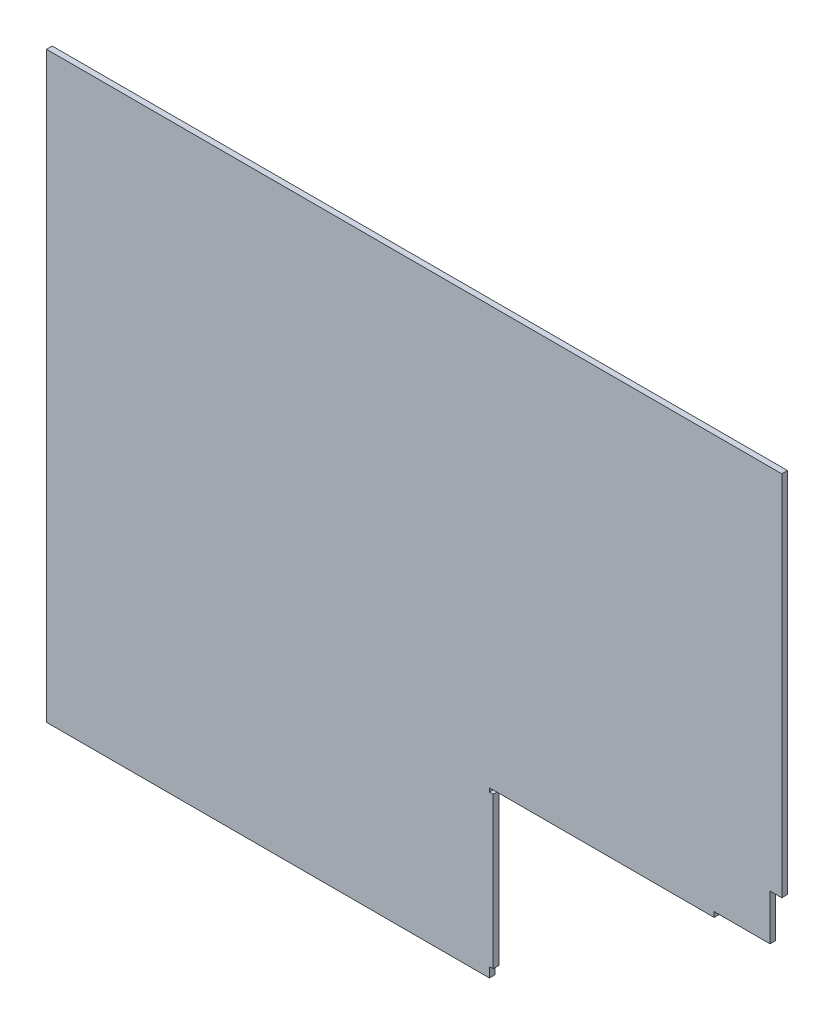
ISO-10303-21;
HEADER;
FILE_DESCRIPTION(('STEP AP214'),'2;1');
FILE_NAME('part.step','',(''),(''),'','','');
FILE_SCHEMA(('AUTOMOTIVE_DESIGN { 1 0 10303 214 1 1 1 1 }'));
ENDSEC;
DATA;
#1=APPLICATION_CONTEXT('core data for automotive mechanical design processes');
#2=APPLICATION_PROTOCOL_DEFINITION('international standard','automotive_design',2000,#1);
#3=PRODUCT_CONTEXT('',#1,'mechanical');
#4=PRODUCT('Part','Part','',(#3));
#5=PRODUCT_RELATED_PRODUCT_CATEGORY('part','',(#4));
#6=PRODUCT_DEFINITION_FORMATION('','',#4);
#7=PRODUCT_DEFINITION_CONTEXT('part definition',#1,'design');
#8=PRODUCT_DEFINITION('design','',#6,#7);
#9=PRODUCT_DEFINITION_SHAPE('','',#8);
#10=(LENGTH_UNIT() NAMED_UNIT(*) SI_UNIT(.MILLI.,.METRE.));
#11=(NAMED_UNIT(*) PLANE_ANGLE_UNIT() SI_UNIT($,.RADIAN.));
#12=(NAMED_UNIT(*) SI_UNIT($,.STERADIAN.) SOLID_ANGLE_UNIT());
#13=UNCERTAINTY_MEASURE_WITH_UNIT(LENGTH_MEASURE(1.E-05),#10,'distance_accuracy_value','');
#14=(GEOMETRIC_REPRESENTATION_CONTEXT(3) GLOBAL_UNCERTAINTY_ASSIGNED_CONTEXT((#13)) GLOBAL_UNIT_ASSIGNED_CONTEXT((#10,
#11,#12)) REPRESENTATION_CONTEXT('',''));
#15=CARTESIAN_POINT('',(0.,0.,0.));
#16=DIRECTION('',(0.,0.,1.));
#17=DIRECTION('',(1.,0.,0.));
#18=AXIS2_PLACEMENT_3D('',#15,#16,#17);
#19=CARTESIAN_POINT('',(289.5,-229.5,2.2479));
#20=DIRECTION('',(-1.,0.,0.));
#21=DIRECTION('',(0.,0.,1.));
#22=AXIS2_PLACEMENT_3D('',#19,#20,#21);
#23=PLANE('',#22);
#24=DIRECTION('',(0.,1.,0.));
#25=VECTOR('',#24,1.);
#26=CARTESIAN_POINT('',(289.5,-229.5,2.2479));
#27=LINE('',#26,#25);
#28=CARTESIAN_POINT('',(289.5,-59.6999999999961,2.24790000000002));
#29=VERTEX_POINT('',#28);
#30=CARTESIAN_POINT('',(289.5,229.5,2.2479));
#31=VERTEX_POINT('',#30);
#32=EDGE_CURVE('E78',#29,#31,#27,.T.);
#33=ORIENTED_EDGE('',*,*,#32,.F.);
#34=DIRECTION('',(0.,0.,-1.));
#35=VECTOR('',#34,1.);
#36=CARTESIAN_POINT('',(289.5,-59.6999999999961,2.2479));
#37=LINE('',#36,#35);
#38=CARTESIAN_POINT('',(289.5,-59.6999999999961,-2.2479));
#39=VERTEX_POINT('',#38);
#40=EDGE_CURVE('E206',#29,#39,#37,.T.);
#41=ORIENTED_EDGE('',*,*,#40,.T.);
#42=DIRECTION('',(0.,1.,0.));
#43=VECTOR('',#42,1.);
#44=CARTESIAN_POINT('',(289.5,-229.5,-2.2479));
#45=LINE('',#44,#43);
#46=CARTESIAN_POINT('',(289.5,229.5,-2.2479));
#47=VERTEX_POINT('',#46);
#48=EDGE_CURVE('E211',#39,#47,#45,.T.);
#49=ORIENTED_EDGE('',*,*,#48,.T.);
#50=DIRECTION('',(0.,0.,-1.));
#51=VECTOR('',#50,1.);
#52=CARTESIAN_POINT('',(289.5,229.5,2.2479));
#53=LINE('',#52,#51);
#54=EDGE_CURVE('E40',#31,#47,#53,.T.);
#55=ORIENTED_EDGE('',*,*,#54,.F.);
#56=EDGE_LOOP('',(#33,#41,#49,#55));
#57=FACE_BOUND('',#56,.T.);
#58=ADVANCED_FACE('F33',(#57),#23,.F.);
#59=CARTESIAN_POINT('',(-289.5,229.5,2.2479));
#60=DIRECTION('',(0.,-1.,0.));
#61=DIRECTION('',(0.,0.,-1.));
#62=AXIS2_PLACEMENT_3D('',#59,#60,#61);
#63=PLANE('',#62);
#64=DIRECTION('',(-1.,0.,0.));
#65=VECTOR('',#64,1.);
#66=CARTESIAN_POINT('',(-289.5,229.5,-2.2479));
#67=LINE('',#66,#65);
#68=CARTESIAN_POINT('',(-289.5,229.5,-2.2479));
#69=VERTEX_POINT('',#68);
#70=EDGE_CURVE('E221',#47,#69,#67,.T.);
#71=ORIENTED_EDGE('',*,*,#70,.T.);
#72=DIRECTION('',(0.,0.,-1.));
#73=VECTOR('',#72,1.);
#74=CARTESIAN_POINT('',(-289.5,229.5,2.2479));
#75=LINE('',#74,#73);
#76=CARTESIAN_POINT('',(-289.5,229.5,2.2479));
#77=VERTEX_POINT('',#76);
#78=EDGE_CURVE('E226',#77,#69,#75,.T.);
#79=ORIENTED_EDGE('',*,*,#78,.F.);
#80=DIRECTION('',(-1.,0.,0.));
#81=VECTOR('',#80,1.);
#82=CARTESIAN_POINT('',(-289.5,229.5,2.2479));
#83=LINE('',#82,#81);
#84=EDGE_CURVE('E213',#31,#77,#83,.T.);
#85=ORIENTED_EDGE('',*,*,#84,.F.);
#86=ORIENTED_EDGE('',*,*,#54,.T.);
#87=EDGE_LOOP('',(#71,#79,#85,#86));
#88=FACE_BOUND('',#87,.T.);
#89=ADVANCED_FACE('F230',(#88),#63,.F.);
#90=CARTESIAN_POINT('',(-289.5,-229.5,2.2479));
#91=DIRECTION('',(1.,0.,0.));
#92=DIRECTION('',(0.,0.,-1.));
#93=AXIS2_PLACEMENT_3D('',#90,#91,#92);
#94=PLANE('',#93);
#95=DIRECTION('',(0.,-1.,0.));
#96=VECTOR('',#95,1.);
#97=CARTESIAN_POINT('',(-289.5,-229.5,-2.2479));
#98=LINE('',#97,#96);
#99=CARTESIAN_POINT('',(-289.5,-229.5,-2.2479));
#100=VERTEX_POINT('',#99);
#101=EDGE_CURVE('E73',#69,#100,#98,.T.);
#102=ORIENTED_EDGE('',*,*,#101,.T.);
#103=DIRECTION('',(0.,0.,-1.));
#104=VECTOR('',#103,1.);
#105=CARTESIAN_POINT('',(-289.5,-229.5,2.2479));
#106=LINE('',#105,#104);
#107=CARTESIAN_POINT('',(-289.5,-229.5,2.2479));
#108=VERTEX_POINT('',#107);
#109=EDGE_CURVE('E219',#108,#100,#106,.T.);
#110=ORIENTED_EDGE('',*,*,#109,.F.);
#111=DIRECTION('',(0.,-1.,0.));
#112=VECTOR('',#111,1.);
#113=CARTESIAN_POINT('',(-289.5,-229.5,2.2479));
#114=LINE('',#113,#112);
#115=EDGE_CURVE('E56',#77,#108,#114,.T.);
#116=ORIENTED_EDGE('',*,*,#115,.F.);
#117=ORIENTED_EDGE('',*,*,#78,.T.);
#118=EDGE_LOOP('',(#102,#110,#116,#117));
#119=FACE_BOUND('',#118,.T.);
#120=ADVANCED_FACE('F239',(#119),#94,.F.);
#121=CARTESIAN_POINT('',(-289.5,-229.5,2.2479));
#122=DIRECTION('',(0.,1.,0.));
#123=DIRECTION('',(0.,0.,1.));
#124=AXIS2_PLACEMENT_3D('',#121,#122,#123);
#125=PLANE('',#124);
#126=DIRECTION('',(1.,0.,0.));
#127=VECTOR('',#126,1.);
#128=CARTESIAN_POINT('',(-289.5,-229.5,-2.2479));
#129=LINE('',#128,#127);
#130=CARTESIAN_POINT('',(59.2499935625001,-229.5,-2.2479));
#131=VERTEX_POINT('',#130);
#132=EDGE_CURVE('E214',#100,#131,#129,.T.);
#133=ORIENTED_EDGE('',*,*,#132,.T.);
#134=DIRECTION('',(0.,0.,1.));
#135=VECTOR('',#134,1.);
#136=CARTESIAN_POINT('',(59.2499935625001,-229.5,2.2479));
#137=LINE('',#136,#135);
#138=CARTESIAN_POINT('',(59.2499935625001,-229.5,2.24790000000002));
#139=VERTEX_POINT('',#138);
#140=EDGE_CURVE('E148',#131,#139,#137,.T.);
#141=ORIENTED_EDGE('',*,*,#140,.T.);
#142=DIRECTION('',(1.,0.,0.));
#143=VECTOR('',#142,1.);
#144=CARTESIAN_POINT('',(-289.5,-229.5,2.2479));
#145=LINE('',#144,#143);
#146=EDGE_CURVE('E217',#108,#139,#145,.T.);
#147=ORIENTED_EDGE('',*,*,#146,.F.);
#148=ORIENTED_EDGE('',*,*,#109,.T.);
#149=EDGE_LOOP('',(#133,#141,#147,#148));
#150=FACE_BOUND('',#149,.T.);
#151=ADVANCED_FACE('F237',(#150),#125,.F.);
#152=CARTESIAN_POINT('',(0.,0.,2.2479));
#153=DIRECTION('',(0.,0.,-1.));
#154=DIRECTION('',(-1.,0.,0.));
#155=AXIS2_PLACEMENT_3D('',#152,#153,#154);
#156=PLANE('',#155);
#157=ORIENTED_EDGE('',*,*,#146,.T.);
#158=DIRECTION('',(0.,-1.,0.));
#159=VECTOR('',#158,1.);
#160=CARTESIAN_POINT('',(59.2499935625001,-221.699999999993,2.24790000000002));
#161=LINE('',#160,#159);
#162=CARTESIAN_POINT('',(59.2499935625001,-221.699999999993,2.24790000000002));
#163=VERTEX_POINT('',#162);
#164=EDGE_CURVE('E191',#163,#139,#161,.T.);
#165=ORIENTED_EDGE('',*,*,#164,.F.);
#166=DIRECTION('',(-1.,0.,0.));
#167=VECTOR('',#166,1.);
#168=CARTESIAN_POINT('',(62.2499935625004,-221.699999999993,2.24790000000002));
#169=LINE('',#168,#167);
#170=CARTESIAN_POINT('',(62.2499935625004,-221.699999999993,2.24790000000002));
#171=VERTEX_POINT('',#170);
#172=EDGE_CURVE('E160',#171,#163,#169,.T.);
#173=ORIENTED_EDGE('',*,*,#172,.F.);
#174=DIRECTION('',(0.,-1.,0.));
#175=VECTOR('',#174,1.);
#176=CARTESIAN_POINT('',(62.2499935625004,-102.699999999993,2.24790000000002));
#177=LINE('',#176,#175);
#178=CARTESIAN_POINT('',(62.2499935625004,-102.699999999993,2.24790000000002));
#179=VERTEX_POINT('',#178);
#180=EDGE_CURVE('E382',#179,#171,#177,.T.);
#181=ORIENTED_EDGE('',*,*,#180,.F.);
#182=DIRECTION('',(1.,0.,0.));
#183=VECTOR('',#182,1.);
#184=CARTESIAN_POINT('',(59.2499935625001,-102.699999999993,2.24790000000002));
#185=LINE('',#184,#183);
#186=CARTESIAN_POINT('',(59.2499935625001,-102.699999999993,2.24790000000002));
#187=VERTEX_POINT('',#186);
#188=EDGE_CURVE('E384',#187,#179,#185,.T.);
#189=ORIENTED_EDGE('',*,*,#188,.F.);
#190=DIRECTION('',(0.,-1.,0.));
#191=VECTOR('',#190,1.);
#192=CARTESIAN_POINT('',(59.2499935625001,-99.6999999999929,2.24790000000002));
#193=LINE('',#192,#191);
#194=CARTESIAN_POINT('',(59.2499935625001,-99.6999999999929,2.24790000000002));
#195=VERTEX_POINT('',#194);
#196=EDGE_CURVE('E390',#195,#187,#193,.T.);
#197=ORIENTED_EDGE('',*,*,#196,.F.);
#198=DIRECTION('',(-1.,0.,0.));
#199=VECTOR('',#198,1.);
#200=CARTESIAN_POINT('',(59.2499935625001,-99.6999999999929,2.24790000000002));
#201=LINE('',#200,#199);
#202=CARTESIAN_POINT('',(236.2499935625,-99.6999999999929,2.24790000000002));
#203=VERTEX_POINT('',#202);
#204=EDGE_CURVE('E392',#203,#195,#201,.T.);
#205=ORIENTED_EDGE('',*,*,#204,.F.);
#206=DIRECTION('',(0.,-1.,0.));
#207=VECTOR('',#206,1.);
#208=CARTESIAN_POINT('',(236.2499935625,-95.6999999999961,2.24790000000002));
#209=LINE('',#208,#207);
#210=CARTESIAN_POINT('',(236.2499935625,-95.6999999999961,2.24790000000002));
#211=VERTEX_POINT('',#210);
#212=EDGE_CURVE('E394',#211,#203,#209,.T.);
#213=ORIENTED_EDGE('',*,*,#212,.F.);
#214=DIRECTION('',(-1.,0.,0.));
#215=VECTOR('',#214,1.);
#216=CARTESIAN_POINT('',(236.2499935625,-95.6999999999961,2.24790000000002));
#217=LINE('',#216,#215);
#218=CARTESIAN_POINT('',(280.2499935625,-95.6999999999961,2.24790000000002));
#219=VERTEX_POINT('',#218);
#220=EDGE_CURVE('E396',#219,#211,#217,.T.);
#221=ORIENTED_EDGE('',*,*,#220,.F.);
#222=DIRECTION('',(0.,-1.,0.));
#223=VECTOR('',#222,1.);
#224=CARTESIAN_POINT('',(280.2499935625,-95.6999999999961,2.24790000000002));
#225=LINE('',#224,#223);
#226=CARTESIAN_POINT('',(280.2499935625,-59.6999999999961,2.24790000000002));
#227=VERTEX_POINT('',#226);
#228=EDGE_CURVE('E207',#227,#219,#225,.T.);
#229=ORIENTED_EDGE('',*,*,#228,.F.);
#230=DIRECTION('',(-1.,0.,0.));
#231=VECTOR('',#230,1.);
#232=CARTESIAN_POINT('',(280.2499935625,-59.6999999999961,2.24790000000002));
#233=LINE('',#232,#231);
#234=EDGE_CURVE('E204',#29,#227,#233,.T.);
#235=ORIENTED_EDGE('',*,*,#234,.F.);
#236=ORIENTED_EDGE('',*,*,#32,.T.);
#237=ORIENTED_EDGE('',*,*,#84,.T.);
#238=ORIENTED_EDGE('',*,*,#115,.T.);
#239=EDGE_LOOP('',(#157,#165,#173,#181,#189,#197,#205,#213,#221,#229,#235,#236,#237,#238));
#240=FACE_BOUND('',#239,.T.);
#241=ADVANCED_FACE('F246',(#240),#156,.F.);
#242=CARTESIAN_POINT('',(0.,0.,-2.2479));
#243=DIRECTION('',(0.,0.,-1.));
#244=DIRECTION('',(-1.,0.,0.));
#245=AXIS2_PLACEMENT_3D('',#242,#243,#244);
#246=PLANE('',#245);
#247=DIRECTION('',(0.,1.,0.));
#248=VECTOR('',#247,1.);
#249=CARTESIAN_POINT('',(59.2499935625001,0.,-2.2479));
#250=LINE('',#249,#248);
#251=CARTESIAN_POINT('',(59.2499935625001,-221.699999999993,-2.2479));
#252=VERTEX_POINT('',#251);
#253=EDGE_CURVE('E11',#131,#252,#250,.T.);
#254=ORIENTED_EDGE('',*,*,#253,.F.);
#255=ORIENTED_EDGE('',*,*,#132,.F.);
#256=ORIENTED_EDGE('',*,*,#101,.F.);
#257=ORIENTED_EDGE('',*,*,#70,.F.);
#258=ORIENTED_EDGE('',*,*,#48,.F.);
#259=DIRECTION('',(1.,0.,0.));
#260=VECTOR('',#259,1.);
#261=CARTESIAN_POINT('',(280.2499935625,-59.6999999999961,-2.2479));
#262=LINE('',#261,#260);
#263=CARTESIAN_POINT('',(280.2499935625,-59.6999999999961,-2.2479));
#264=VERTEX_POINT('',#263);
#265=EDGE_CURVE('E168',#264,#39,#262,.T.);
#266=ORIENTED_EDGE('',*,*,#265,.F.);
#267=DIRECTION('',(0.,1.,0.));
#268=VECTOR('',#267,1.);
#269=CARTESIAN_POINT('',(280.2499935625,-95.6999999999961,-2.2479));
#270=LINE('',#269,#268);
#271=CARTESIAN_POINT('',(280.2499935625,-95.6999999999961,-2.2479));
#272=VERTEX_POINT('',#271);
#273=EDGE_CURVE('E47',#272,#264,#270,.T.);
#274=ORIENTED_EDGE('',*,*,#273,.F.);
#275=DIRECTION('',(1.,0.,0.));
#276=VECTOR('',#275,1.);
#277=CARTESIAN_POINT('',(236.2499935625,-95.6999999999961,-2.2479));
#278=LINE('',#277,#276);
#279=CARTESIAN_POINT('',(236.2499935625,-95.6999999999961,-2.2479));
#280=VERTEX_POINT('',#279);
#281=EDGE_CURVE('E186',#280,#272,#278,.T.);
#282=ORIENTED_EDGE('',*,*,#281,.F.);
#283=DIRECTION('',(0.,1.,0.));
#284=VECTOR('',#283,1.);
#285=CARTESIAN_POINT('',(236.2499935625,-95.6999999999961,-2.2479));
#286=LINE('',#285,#284);
#287=CARTESIAN_POINT('',(236.2499935625,-99.6999999999929,-2.2479));
#288=VERTEX_POINT('',#287);
#289=EDGE_CURVE('E183',#288,#280,#286,.T.);
#290=ORIENTED_EDGE('',*,*,#289,.F.);
#291=DIRECTION('',(1.,0.,0.));
#292=VECTOR('',#291,1.);
#293=CARTESIAN_POINT('',(59.2499935625001,-99.6999999999929,-2.2479));
#294=LINE('',#293,#292);
#295=CARTESIAN_POINT('',(59.2499935625001,-99.6999999999929,-2.2479));
#296=VERTEX_POINT('',#295);
#297=EDGE_CURVE('E180',#296,#288,#294,.T.);
#298=ORIENTED_EDGE('',*,*,#297,.F.);
#299=DIRECTION('',(0.,1.,0.));
#300=VECTOR('',#299,1.);
#301=CARTESIAN_POINT('',(59.2499935625001,-99.6999999999929,-2.2479));
#302=LINE('',#301,#300);
#303=CARTESIAN_POINT('',(59.2499935625001,-102.699999999993,-2.2479));
#304=VERTEX_POINT('',#303);
#305=EDGE_CURVE('E177',#304,#296,#302,.T.);
#306=ORIENTED_EDGE('',*,*,#305,.F.);
#307=DIRECTION('',(-1.,0.,0.));
#308=VECTOR('',#307,1.);
#309=CARTESIAN_POINT('',(59.2499935625001,-102.699999999993,-2.2479));
#310=LINE('',#309,#308);
#311=CARTESIAN_POINT('',(62.2499935625004,-102.699999999993,-2.2479));
#312=VERTEX_POINT('',#311);
#313=EDGE_CURVE('E170',#312,#304,#310,.T.);
#314=ORIENTED_EDGE('',*,*,#313,.F.);
#315=DIRECTION('',(0.,1.,0.));
#316=VECTOR('',#315,1.);
#317=CARTESIAN_POINT('',(62.2499935625004,-102.699999999993,-2.2479));
#318=LINE('',#317,#316);
#319=CARTESIAN_POINT('',(62.2499935625004,-221.699999999993,-2.2479));
#320=VERTEX_POINT('',#319);
#321=EDGE_CURVE('E167',#320,#312,#318,.T.);
#322=ORIENTED_EDGE('',*,*,#321,.F.);
#323=DIRECTION('',(1.,0.,0.));
#324=VECTOR('',#323,1.);
#325=CARTESIAN_POINT('',(62.2499935625004,-221.699999999993,-2.2479));
#326=LINE('',#325,#324);
#327=EDGE_CURVE('E157',#252,#320,#326,.T.);
#328=ORIENTED_EDGE('',*,*,#327,.F.);
#329=EDGE_LOOP('',(#254,#255,#256,#257,#258,#266,#274,#282,#290,#298,#306,#314,#322,#328));
#330=FACE_BOUND('',#329,.T.);
#331=ADVANCED_FACE('F164',(#330),#246,.T.);
#332=CARTESIAN_POINT('',(59.2499935625001,-221.699999999993,289.036420465704));
#333=DIRECTION('',(-1.,0.,0.));
#334=DIRECTION('',(0.,0.,1.));
#335=AXIS2_PLACEMENT_3D('',#332,#333,#334);
#336=PLANE('',#335);
#337=ORIENTED_EDGE('',*,*,#253,.T.);
#338=DIRECTION('',(0.,0.,-1.));
#339=VECTOR('',#338,1.);
#340=CARTESIAN_POINT('',(59.2499935625001,-221.699999999993,289.036420465704));
#341=LINE('',#340,#339);
#342=EDGE_CURVE('E145',#163,#252,#341,.T.);
#343=ORIENTED_EDGE('',*,*,#342,.F.);
#344=ORIENTED_EDGE('',*,*,#164,.T.);
#345=ORIENTED_EDGE('',*,*,#140,.F.);
#346=EDGE_LOOP('',(#337,#343,#344,#345));
#347=FACE_BOUND('',#346,.T.);
#348=ADVANCED_FACE('F144',(#347),#336,.F.);
#349=CARTESIAN_POINT('',(280.2499935625,-59.6999999999961,289.036420465704));
#350=DIRECTION('',(0.,1.,0.));
#351=DIRECTION('',(0.,0.,1.));
#352=AXIS2_PLACEMENT_3D('',#349,#350,#351);
#353=PLANE('',#352);
#354=ORIENTED_EDGE('',*,*,#234,.T.);
#355=DIRECTION('',(0.,0.,-1.));
#356=VECTOR('',#355,1.);
#357=CARTESIAN_POINT('',(280.2499935625,-59.6999999999961,289.036420465704));
#358=LINE('',#357,#356);
#359=EDGE_CURVE('E162',#227,#264,#358,.T.);
#360=ORIENTED_EDGE('',*,*,#359,.T.);
#361=ORIENTED_EDGE('',*,*,#265,.T.);
#362=ORIENTED_EDGE('',*,*,#40,.F.);
#363=EDGE_LOOP('',(#354,#360,#361,#362));
#364=FACE_BOUND('',#363,.T.);
#365=ADVANCED_FACE('F288',(#364),#353,.F.);
#366=CARTESIAN_POINT('',(280.2499935625,-95.6999999999961,289.036420465704));
#367=DIRECTION('',(-1.,0.,0.));
#368=DIRECTION('',(0.,0.,1.));
#369=AXIS2_PLACEMENT_3D('',#366,#367,#368);
#370=PLANE('',#369);
#371=ORIENTED_EDGE('',*,*,#228,.T.);
#372=DIRECTION('',(0.,0.,-1.));
#373=VECTOR('',#372,1.);
#374=CARTESIAN_POINT('',(280.2499935625,-95.6999999999961,289.036420465704));
#375=LINE('',#374,#373);
#376=EDGE_CURVE('E189',#219,#272,#375,.T.);
#377=ORIENTED_EDGE('',*,*,#376,.T.);
#378=ORIENTED_EDGE('',*,*,#273,.T.);
#379=ORIENTED_EDGE('',*,*,#359,.F.);
#380=EDGE_LOOP('',(#371,#377,#378,#379));
#381=FACE_BOUND('',#380,.T.);
#382=ADVANCED_FACE('F296',(#381),#370,.F.);
#383=CARTESIAN_POINT('',(236.2499935625,-95.6999999999961,289.036420465704));
#384=DIRECTION('',(0.,1.,0.));
#385=DIRECTION('',(0.,0.,1.));
#386=AXIS2_PLACEMENT_3D('',#383,#384,#385);
#387=PLANE('',#386);
#388=ORIENTED_EDGE('',*,*,#220,.T.);
#389=DIRECTION('',(0.,0.,-1.));
#390=VECTOR('',#389,1.);
#391=CARTESIAN_POINT('',(236.2499935625,-95.6999999999961,289.036420465704));
#392=LINE('',#391,#390);
#393=EDGE_CURVE('E192',#211,#280,#392,.T.);
#394=ORIENTED_EDGE('',*,*,#393,.T.);
#395=ORIENTED_EDGE('',*,*,#281,.T.);
#396=ORIENTED_EDGE('',*,*,#376,.F.);
#397=EDGE_LOOP('',(#388,#394,#395,#396));
#398=FACE_BOUND('',#397,.T.);
#399=ADVANCED_FACE('F305',(#398),#387,.F.);
#400=CARTESIAN_POINT('',(236.2499935625,-95.6999999999961,289.036420465704));
#401=DIRECTION('',(-1.,0.,0.));
#402=DIRECTION('',(0.,0.,1.));
#403=AXIS2_PLACEMENT_3D('',#400,#401,#402);
#404=PLANE('',#403);
#405=ORIENTED_EDGE('',*,*,#212,.T.);
#406=DIRECTION('',(0.,0.,-1.));
#407=VECTOR('',#406,1.);
#408=CARTESIAN_POINT('',(236.2499935625,-99.6999999999929,289.036420465704));
#409=LINE('',#408,#407);
#410=EDGE_CURVE('E194',#203,#288,#409,.T.);
#411=ORIENTED_EDGE('',*,*,#410,.T.);
#412=ORIENTED_EDGE('',*,*,#289,.T.);
#413=ORIENTED_EDGE('',*,*,#393,.F.);
#414=EDGE_LOOP('',(#405,#411,#412,#413));
#415=FACE_BOUND('',#414,.T.);
#416=ADVANCED_FACE('F313',(#415),#404,.F.);
#417=CARTESIAN_POINT('',(59.2499935625001,-99.6999999999929,289.036420465704));
#418=DIRECTION('',(0.,1.,0.));
#419=DIRECTION('',(0.,0.,1.));
#420=AXIS2_PLACEMENT_3D('',#417,#418,#419);
#421=PLANE('',#420);
#422=ORIENTED_EDGE('',*,*,#204,.T.);
#423=DIRECTION('',(0.,0.,-1.));
#424=VECTOR('',#423,1.);
#425=CARTESIAN_POINT('',(59.2499935625001,-99.6999999999929,289.036420465704));
#426=LINE('',#425,#424);
#427=EDGE_CURVE('E196',#195,#296,#426,.T.);
#428=ORIENTED_EDGE('',*,*,#427,.T.);
#429=ORIENTED_EDGE('',*,*,#297,.T.);
#430=ORIENTED_EDGE('',*,*,#410,.F.);
#431=EDGE_LOOP('',(#422,#428,#429,#430));
#432=FACE_BOUND('',#431,.T.);
#433=ADVANCED_FACE('F322',(#432),#421,.F.);
#434=CARTESIAN_POINT('',(59.2499935625001,-99.6999999999929,289.036420465704));
#435=DIRECTION('',(-1.,0.,0.));
#436=DIRECTION('',(0.,0.,1.));
#437=AXIS2_PLACEMENT_3D('',#434,#435,#436);
#438=PLANE('',#437);
#439=ORIENTED_EDGE('',*,*,#196,.T.);
#440=DIRECTION('',(0.,0.,-1.));
#441=VECTOR('',#440,1.);
#442=CARTESIAN_POINT('',(59.2499935625001,-102.699999999993,289.036420465704));
#443=LINE('',#442,#441);
#444=EDGE_CURVE('E198',#187,#304,#443,.T.);
#445=ORIENTED_EDGE('',*,*,#444,.T.);
#446=ORIENTED_EDGE('',*,*,#305,.T.);
#447=ORIENTED_EDGE('',*,*,#427,.F.);
#448=EDGE_LOOP('',(#439,#445,#446,#447));
#449=FACE_BOUND('',#448,.T.);
#450=ADVANCED_FACE('F331',(#449),#438,.F.);
#451=CARTESIAN_POINT('',(59.2499935625001,-102.699999999993,289.036420465704));
#452=DIRECTION('',(0.,-1.,0.));
#453=DIRECTION('',(0.,0.,-1.));
#454=AXIS2_PLACEMENT_3D('',#451,#452,#453);
#455=PLANE('',#454);
#456=ORIENTED_EDGE('',*,*,#188,.T.);
#457=DIRECTION('',(0.,0.,-1.));
#458=VECTOR('',#457,1.);
#459=CARTESIAN_POINT('',(62.2499935625004,-102.699999999993,289.036420465704));
#460=LINE('',#459,#458);
#461=EDGE_CURVE('E200',#179,#312,#460,.T.);
#462=ORIENTED_EDGE('',*,*,#461,.T.);
#463=ORIENTED_EDGE('',*,*,#313,.T.);
#464=ORIENTED_EDGE('',*,*,#444,.F.);
#465=EDGE_LOOP('',(#456,#462,#463,#464));
#466=FACE_BOUND('',#465,.T.);
#467=ADVANCED_FACE('F340',(#466),#455,.F.);
#468=CARTESIAN_POINT('',(62.2499935625004,-102.699999999993,289.036420465704));
#469=DIRECTION('',(-1.,0.,0.));
#470=DIRECTION('',(0.,0.,1.));
#471=AXIS2_PLACEMENT_3D('',#468,#469,#470);
#472=PLANE('',#471);
#473=ORIENTED_EDGE('',*,*,#180,.T.);
#474=DIRECTION('',(0.,0.,-1.));
#475=VECTOR('',#474,1.);
#476=CARTESIAN_POINT('',(62.2499935625004,-221.699999999993,289.036420465704));
#477=LINE('',#476,#475);
#478=EDGE_CURVE('E161',#171,#320,#477,.T.);
#479=ORIENTED_EDGE('',*,*,#478,.T.);
#480=ORIENTED_EDGE('',*,*,#321,.T.);
#481=ORIENTED_EDGE('',*,*,#461,.F.);
#482=EDGE_LOOP('',(#473,#479,#480,#481));
#483=FACE_BOUND('',#482,.T.);
#484=ADVANCED_FACE('F349',(#483),#472,.F.);
#485=CARTESIAN_POINT('',(62.2499935625004,-221.699999999993,289.036420465704));
#486=DIRECTION('',(0.,1.,0.));
#487=DIRECTION('',(0.,0.,1.));
#488=AXIS2_PLACEMENT_3D('',#485,#486,#487);
#489=PLANE('',#488);
#490=ORIENTED_EDGE('',*,*,#172,.T.);
#491=ORIENTED_EDGE('',*,*,#342,.T.);
#492=ORIENTED_EDGE('',*,*,#327,.T.);
#493=ORIENTED_EDGE('',*,*,#478,.F.);
#494=EDGE_LOOP('',(#490,#491,#492,#493));
#495=FACE_BOUND('',#494,.T.);
#496=ADVANCED_FACE('F155',(#495),#489,.F.);
#497=CLOSED_SHELL('',(#58,#89,#120,#151,#241,#331,#348,#365,#382,#399,#416,#433,#450,#467,#484,#496));
#498=MANIFOLD_SOLID_BREP('B2',#497);
#499=ADVANCED_BREP_SHAPE_REPRESENTATION('',(#18,#498),#14);
#500=SHAPE_DEFINITION_REPRESENTATION(#9,#499);
ENDSEC;
END-ISO-10303-21;
